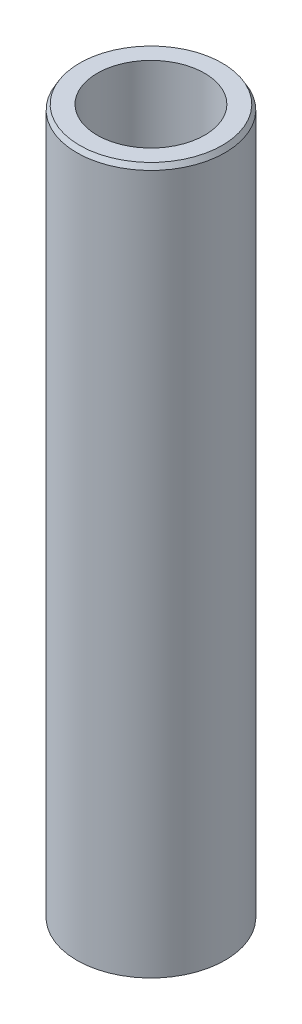
ISO-10303-21;
HEADER;
FILE_DESCRIPTION(('STEP AP214'),'2;1');
FILE_NAME('part.step','',(''),(''),'','','');
FILE_SCHEMA(('AUTOMOTIVE_DESIGN { 1 0 10303 214 1 1 1 1 }'));
ENDSEC;
DATA;
#1=APPLICATION_CONTEXT('core data for automotive mechanical design processes');
#2=APPLICATION_PROTOCOL_DEFINITION('international standard','automotive_design',2000,#1);
#3=PRODUCT_CONTEXT('',#1,'mechanical');
#4=PRODUCT('Part','Part','',(#3));
#5=PRODUCT_RELATED_PRODUCT_CATEGORY('part','',(#4));
#6=PRODUCT_DEFINITION_FORMATION('','',#4);
#7=PRODUCT_DEFINITION_CONTEXT('part definition',#1,'design');
#8=PRODUCT_DEFINITION('design','',#6,#7);
#9=PRODUCT_DEFINITION_SHAPE('','',#8);
#10=(LENGTH_UNIT() NAMED_UNIT(*) SI_UNIT(.MILLI.,.METRE.));
#11=(NAMED_UNIT(*) PLANE_ANGLE_UNIT() SI_UNIT($,.RADIAN.));
#12=(NAMED_UNIT(*) SI_UNIT($,.STERADIAN.) SOLID_ANGLE_UNIT());
#13=UNCERTAINTY_MEASURE_WITH_UNIT(LENGTH_MEASURE(1.E-05),#10,'distance_accuracy_value','');
#14=(GEOMETRIC_REPRESENTATION_CONTEXT(3) GLOBAL_UNCERTAINTY_ASSIGNED_CONTEXT((#13)) GLOBAL_UNIT_ASSIGNED_CONTEXT((#10,
#11,#12)) REPRESENTATION_CONTEXT('',''));
#15=CARTESIAN_POINT('',(0.,0.,0.));
#16=DIRECTION('',(0.,0.,1.));
#17=DIRECTION('',(1.,0.,0.));
#18=AXIS2_PLACEMENT_3D('',#15,#16,#17);
#19=CARTESIAN_POINT('',(0.,381.434596674402,0.));
#20=DIRECTION('',(0.,-1.,0.));
#21=DIRECTION('',(0.,0.,-1.));
#22=AXIS2_PLACEMENT_3D('',#19,#20,#21);
#23=CYLINDRICAL_SURFACE('',#22,40.);
#24=CARTESIAN_POINT('',(0.,378.774944682379,0.));
#25=DIRECTION('',(0.,1.,0.));
#26=DIRECTION('',(0.,0.,1.));
#27=AXIS2_PLACEMENT_3D('',#24,#25,#26);
#28=CIRCLE('',#27,40.);
#29=CARTESIAN_POINT('',(0.,378.774944682379,40.));
#30=VERTEX_POINT('',#29);
#31=EDGE_CURVE('E50',#30,#30,#28,.F.);
#32=ORIENTED_EDGE('',*,*,#31,.T.);
#33=EDGE_LOOP('',(#32));
#34=FACE_BOUND('',#33,.T.);
#35=CARTESIAN_POINT('',(0.,1.53555079354478,0.));
#36=DIRECTION('',(0.,1.,0.));
#37=DIRECTION('',(0.,0.,1.));
#38=AXIS2_PLACEMENT_3D('',#35,#36,#37);
#39=CIRCLE('',#38,40.);
#40=CARTESIAN_POINT('',(0.,1.53555079354478,40.));
#41=VERTEX_POINT('',#40);
#42=EDGE_CURVE('E51',#41,#41,#39,.T.);
#43=ORIENTED_EDGE('',*,*,#42,.T.);
#44=EDGE_LOOP('',(#43));
#45=FACE_BOUND('',#44,.T.);
#46=ADVANCED_FACE('F39',(#34,#45),#23,.T.);
#47=CARTESIAN_POINT('',(0.,381.434596674402,0.));
#48=DIRECTION('',(0.,1.,0.));
#49=DIRECTION('',(0.,0.,1.));
#50=AXIS2_PLACEMENT_3D('',#47,#48,#49);
#51=PLANE('',#50);
#52=CARTESIAN_POINT('',(0.,381.434596674402,0.));
#53=DIRECTION('',(0.,1.,0.));
#54=DIRECTION('',(0.,0.,1.));
#55=AXIS2_PLACEMENT_3D('',#52,#53,#54);
#56=CIRCLE('',#55,38.4644492064551);
#57=CARTESIAN_POINT('',(0.,381.434596674402,38.4644492064551));
#58=VERTEX_POINT('',#57);
#59=EDGE_CURVE('E54',#58,#58,#56,.T.);
#60=ORIENTED_EDGE('',*,*,#59,.T.);
#61=EDGE_LOOP('',(#60));
#62=FACE_BOUND('',#61,.T.);
#63=CARTESIAN_POINT('',(0.,381.434596674402,0.));
#64=DIRECTION('',(0.,1.,0.));
#65=DIRECTION('',(0.,0.,1.));
#66=AXIS2_PLACEMENT_3D('',#63,#64,#65);
#67=CIRCLE('',#66,28.9729810571439);
#68=CARTESIAN_POINT('',(0.,381.434596674402,28.9729810571439));
#69=VERTEX_POINT('',#68);
#70=EDGE_CURVE('E58',#69,#69,#67,.T.);
#71=ORIENTED_EDGE('',*,*,#70,.F.);
#72=EDGE_LOOP('',(#71));
#73=FACE_BOUND('',#72,.T.);
#74=ADVANCED_FACE('F69',(#62,#73),#51,.T.);
#75=CARTESIAN_POINT('',(0.,0.,0.));
#76=DIRECTION('',(0.,1.,0.));
#77=DIRECTION('',(0.,0.,1.));
#78=AXIS2_PLACEMENT_3D('',#75,#76,#77);
#79=PLANE('',#78);
#80=CARTESIAN_POINT('',(0.,0.,0.));
#81=DIRECTION('',(0.,1.,0.));
#82=DIRECTION('',(0.,0.,1.));
#83=AXIS2_PLACEMENT_3D('',#80,#81,#82);
#84=CIRCLE('',#83,37.3403480079777);
#85=CARTESIAN_POINT('',(0.,0.,37.3403480079777));
#86=VERTEX_POINT('',#85);
#87=EDGE_CURVE('E10',#86,#86,#84,.F.);
#88=ORIENTED_EDGE('',*,*,#87,.T.);
#89=EDGE_LOOP('',(#88));
#90=FACE_BOUND('',#89,.T.);
#91=CARTESIAN_POINT('',(0.,0.,0.));
#92=DIRECTION('',(0.,1.,0.));
#93=DIRECTION('',(0.,0.,1.));
#94=AXIS2_PLACEMENT_3D('',#91,#92,#93);
#95=CIRCLE('',#94,28.9729810571439);
#96=CARTESIAN_POINT('',(0.,0.,28.9729810571439));
#97=VERTEX_POINT('',#96);
#98=EDGE_CURVE('E63',#97,#97,#95,.T.);
#99=ORIENTED_EDGE('',*,*,#98,.T.);
#100=EDGE_LOOP('',(#99));
#101=FACE_BOUND('',#100,.T.);
#102=ADVANCED_FACE('F75',(#90,#101),#79,.F.);
#103=CARTESIAN_POINT('',(0.,381.434596674402,0.));
#104=DIRECTION('',(0.,-1.,0.));
#105=DIRECTION('',(0.,0.,-1.));
#106=AXIS2_PLACEMENT_3D('',#103,#104,#105);
#107=CYLINDRICAL_SURFACE('',#106,28.9729810571439);
#108=ORIENTED_EDGE('',*,*,#70,.T.);
#109=EDGE_LOOP('',(#108));
#110=FACE_BOUND('',#109,.T.);
#111=ORIENTED_EDGE('',*,*,#98,.F.);
#112=EDGE_LOOP('',(#111));
#113=FACE_BOUND('',#112,.T.);
#114=ADVANCED_FACE('F70',(#110,#113),#107,.F.);
#115=CARTESIAN_POINT('',(0.,381.434596674402,0.));
#116=DIRECTION('',(0.,-1.,0.));
#117=DIRECTION('',(0.,0.,-1.));
#118=AXIS2_PLACEMENT_3D('',#115,#116,#117);
#119=CONICAL_SURFACE('',#118,38.4644492064551,0.52359877559829);
#120=ORIENTED_EDGE('',*,*,#31,.F.);
#121=EDGE_LOOP('',(#120));
#122=FACE_BOUND('',#121,.T.);
#123=ORIENTED_EDGE('',*,*,#59,.F.);
#124=EDGE_LOOP('',(#123));
#125=FACE_BOUND('',#124,.T.);
#126=ADVANCED_FACE('F81',(#122,#125),#119,.T.);
#127=CARTESIAN_POINT('',(0.,1.53555079354478,0.));
#128=DIRECTION('',(0.,1.,0.));
#129=DIRECTION('',(0.,0.,1.));
#130=AXIS2_PLACEMENT_3D('',#127,#128,#129);
#131=CONICAL_SURFACE('',#130,40.,1.0471975511966);
#132=ORIENTED_EDGE('',*,*,#87,.F.);
#133=EDGE_LOOP('',(#132));
#134=FACE_BOUND('',#133,.T.);
#135=ORIENTED_EDGE('',*,*,#42,.F.);
#136=EDGE_LOOP('',(#135));
#137=FACE_BOUND('',#136,.T.);
#138=ADVANCED_FACE('F45',(#134,#137),#131,.T.);
#139=CLOSED_SHELL('',(#46,#74,#102,#114,#126,#138));
#140=MANIFOLD_SOLID_BREP('B2',#139);
#141=ADVANCED_BREP_SHAPE_REPRESENTATION('',(#18,#140),#14);
#142=SHAPE_DEFINITION_REPRESENTATION(#9,#141);
ENDSEC;
END-ISO-10303-21;
